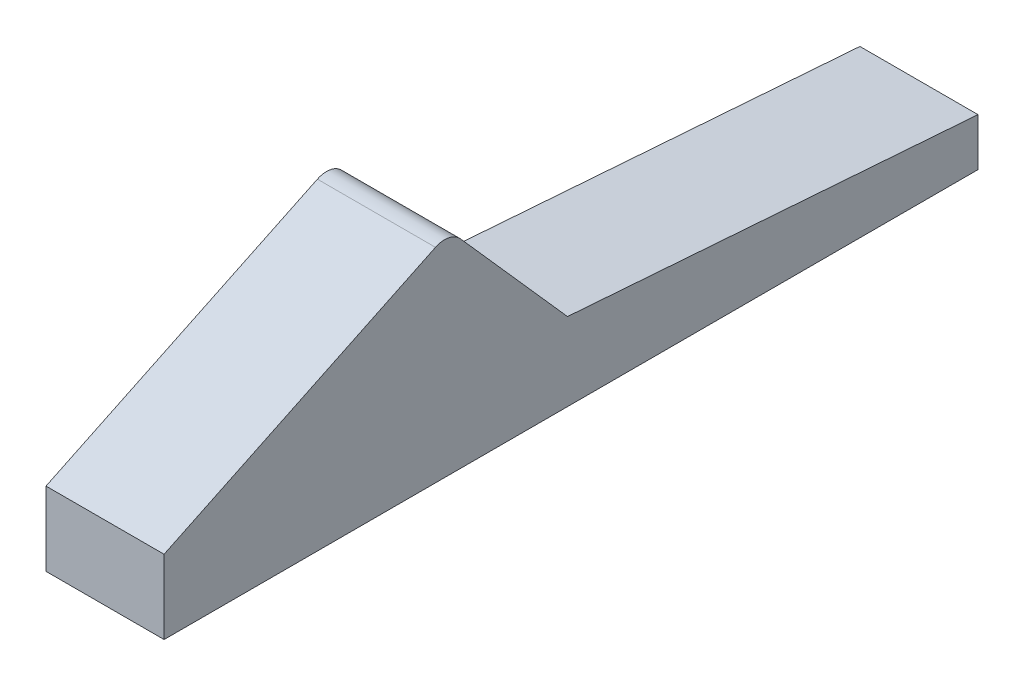
ISO-10303-21;
HEADER;
FILE_DESCRIPTION(('STEP AP214'),'2;1');
FILE_NAME('part.step','',(''),(''),'','','');
FILE_SCHEMA(('AUTOMOTIVE_DESIGN { 1 0 10303 214 1 1 1 1 }'));
ENDSEC;
DATA;
#1=APPLICATION_CONTEXT('core data for automotive mechanical design processes');
#2=APPLICATION_PROTOCOL_DEFINITION('international standard','automotive_design',2000,#1);
#3=PRODUCT_CONTEXT('',#1,'mechanical');
#4=PRODUCT('Part','Part','',(#3));
#5=PRODUCT_RELATED_PRODUCT_CATEGORY('part','',(#4));
#6=PRODUCT_DEFINITION_FORMATION('','',#4);
#7=PRODUCT_DEFINITION_CONTEXT('part definition',#1,'design');
#8=PRODUCT_DEFINITION('design','',#6,#7);
#9=PRODUCT_DEFINITION_SHAPE('','',#8);
#10=(LENGTH_UNIT() NAMED_UNIT(*) SI_UNIT(.MILLI.,.METRE.));
#11=(NAMED_UNIT(*) PLANE_ANGLE_UNIT() SI_UNIT($,.RADIAN.));
#12=(NAMED_UNIT(*) SI_UNIT($,.STERADIAN.) SOLID_ANGLE_UNIT());
#13=UNCERTAINTY_MEASURE_WITH_UNIT(LENGTH_MEASURE(1.E-05),#10,'distance_accuracy_value','');
#14=(GEOMETRIC_REPRESENTATION_CONTEXT(3) GLOBAL_UNCERTAINTY_ASSIGNED_CONTEXT((#13)) GLOBAL_UNIT_ASSIGNED_CONTEXT((#10,
#11,#12)) REPRESENTATION_CONTEXT('',''));
#15=CARTESIAN_POINT('',(0.,0.,0.));
#16=DIRECTION('',(0.,0.,1.));
#17=DIRECTION('',(1.,0.,0.));
#18=AXIS2_PLACEMENT_3D('',#15,#16,#17);
#19=CARTESIAN_POINT('',(3.38899081923676,31.4874983767543,159.021588396583));
#20=DIRECTION('',(0.,0.,1.));
#21=DIRECTION('',(0.,-1.,0.));
#22=AXIS2_PLACEMENT_3D('',#19,#20,#21);
#23=PLANE('',#22);
#24=DIRECTION('',(0.,-1.,0.));
#25=VECTOR('',#24,1.);
#26=CARTESIAN_POINT('',(2.82899081923676,31.4874983767543,159.021588396583));
#27=LINE('',#26,#25);
#28=CARTESIAN_POINT('',(2.82899081923676,30.7134983767543,159.021588396583));
#29=VERTEX_POINT('',#28);
#30=CARTESIAN_POINT('',(2.82899081923676,30.4874983767543,159.021588396583));
#31=VERTEX_POINT('',#30);
#32=EDGE_CURVE('E141',#29,#31,#27,.T.);
#33=ORIENTED_EDGE('',*,*,#32,.F.);
#34=DIRECTION('',(1.,0.,0.));
#35=VECTOR('',#34,1.);
#36=CARTESIAN_POINT('',(2.38899081923676,30.7134983767543,159.021588396583));
#37=LINE('',#36,#35);
#38=CARTESIAN_POINT('',(3.38899081923676,30.7134983767543,159.021588396583));
#39=VERTEX_POINT('',#38);
#40=EDGE_CURVE('E90',#29,#39,#37,.T.);
#41=ORIENTED_EDGE('',*,*,#40,.T.);
#42=DIRECTION('',(0.,-1.,0.));
#43=VECTOR('',#42,1.);
#44=CARTESIAN_POINT('',(3.38899081923676,31.4874983767543,159.021588396583));
#45=LINE('',#44,#43);
#46=CARTESIAN_POINT('',(3.38899081923676,30.4874983767543,159.021588396583));
#47=VERTEX_POINT('',#46);
#48=EDGE_CURVE('E95',#39,#47,#45,.T.);
#49=ORIENTED_EDGE('',*,*,#48,.T.);
#50=DIRECTION('',(-1.,0.,0.));
#51=VECTOR('',#50,1.);
#52=CARTESIAN_POINT('',(3.38899081923676,30.4874983767543,159.021588396583));
#53=LINE('',#52,#51);
#54=EDGE_CURVE('E119',#47,#31,#53,.T.);
#55=ORIENTED_EDGE('',*,*,#54,.T.);
#56=EDGE_LOOP('',(#33,#41,#49,#55));
#57=FACE_BOUND('',#56,.T.);
#58=ADVANCED_FACE('F17',(#57),#23,.F.);
#59=CARTESIAN_POINT('',(2.82899081923676,31.4874983767543,159.021588396583));
#60=DIRECTION('',(1.,0.,0.));
#61=DIRECTION('',(0.,1.,0.));
#62=AXIS2_PLACEMENT_3D('',#59,#60,#61);
#63=PLANE('',#62);
#64=DIRECTION('',(0.,0.432255420004612,-0.901751213959059));
#65=VECTOR('',#64,1.);
#66=CARTESIAN_POINT('',(2.82899081923677,32.4638638990212,159.489610266));
#67=LINE('',#66,#65);
#68=CARTESIAN_POINT('',(2.82899081923679,30.8379155123873,162.881588396583));
#69=VERTEX_POINT('',#68);
#70=CARTESIAN_POINT('',(2.82899081923678,31.4548836689918,161.594498036475));
#71=VERTEX_POINT('',#70);
#72=EDGE_CURVE('E116',#69,#71,#67,.T.);
#73=ORIENTED_EDGE('',*,*,#72,.T.);
#74=CARTESIAN_POINT('',(2.82899081923678,31.3647085475959,161.551272494475));
#75=DIRECTION('',(1.,0.,0.));
#76=DIRECTION('',(0.,1.,0.));
#77=AXIS2_PLACEMENT_3D('',#74,#75,#76);
#78=CIRCLE('',#77,0.1);
#79=CARTESIAN_POINT('',(2.82899081923678,31.4310227222689,161.476423110794));
#80=VERTEX_POINT('',#79);
#81=EDGE_CURVE('E40',#71,#80,#78,.F.);
#82=ORIENTED_EDGE('',*,*,#81,.T.);
#83=DIRECTION('',(0.,-0.748493836810502,-0.663141746730436));
#84=VECTOR('',#83,1.);
#85=CARTESIAN_POINT('',(2.82899081923677,30.2441871666159,160.424924534919));
#86=LINE('',#85,#84);
#87=CARTESIAN_POINT('',(2.82899081923677,30.8574983767543,160.968298771524));
#88=VERTEX_POINT('',#87);
#89=EDGE_CURVE('E103',#80,#88,#86,.T.);
#90=ORIENTED_EDGE('',*,*,#89,.T.);
#91=DIRECTION('',(0.,-0.073769395194858,-0.997275326242751));
#92=VECTOR('',#91,1.);
#93=CARTESIAN_POINT('',(2.82899081923676,30.7177104256729,159.078530336371));
#94=LINE('',#93,#92);
#95=EDGE_CURVE('E88',#88,#29,#94,.T.);
#96=ORIENTED_EDGE('',*,*,#95,.T.);
#97=ORIENTED_EDGE('',*,*,#32,.T.);
#98=DIRECTION('',(0.,0.,1.));
#99=VECTOR('',#98,1.);
#100=CARTESIAN_POINT('',(2.82899081923676,30.4874983767543,159.021588396583));
#101=LINE('',#100,#99);
#102=CARTESIAN_POINT('',(2.82899081923679,30.4874983767543,162.881588396583));
#103=VERTEX_POINT('',#102);
#104=EDGE_CURVE('E123',#31,#103,#101,.T.);
#105=ORIENTED_EDGE('',*,*,#104,.T.);
#106=DIRECTION('',(0.,-1.,0.));
#107=VECTOR('',#106,1.);
#108=CARTESIAN_POINT('',(2.82899081923679,31.4874983767543,162.881588396583));
#109=LINE('',#108,#107);
#110=EDGE_CURVE('E138',#69,#103,#109,.T.);
#111=ORIENTED_EDGE('',*,*,#110,.F.);
#112=EDGE_LOOP('',(#73,#82,#90,#96,#97,#105,#111));
#113=FACE_BOUND('',#112,.T.);
#114=ADVANCED_FACE('F158',(#113),#63,.F.);
#115=CARTESIAN_POINT('',(3.38899081923678,31.4874983767543,162.881588396583));
#116=DIRECTION('',(0.,0.,-1.));
#117=DIRECTION('',(0.,1.,0.));
#118=AXIS2_PLACEMENT_3D('',#115,#116,#117);
#119=PLANE('',#118);
#120=DIRECTION('',(0.,-1.,0.));
#121=VECTOR('',#120,1.);
#122=CARTESIAN_POINT('',(3.38899081923678,31.4874983767543,162.881588396583));
#123=LINE('',#122,#121);
#124=CARTESIAN_POINT('',(3.38899081923678,30.8379155123873,162.881588396583));
#125=VERTEX_POINT('',#124);
#126=CARTESIAN_POINT('',(3.38899081923678,30.4874983767543,162.881588396583));
#127=VERTEX_POINT('',#126);
#128=EDGE_CURVE('E135',#125,#127,#123,.T.);
#129=ORIENTED_EDGE('',*,*,#128,.F.);
#130=DIRECTION('',(1.,0.,0.));
#131=VECTOR('',#130,1.);
#132=CARTESIAN_POINT('',(2.38899081923678,30.8379155123873,162.881588396583));
#133=LINE('',#132,#131);
#134=EDGE_CURVE('E113',#69,#125,#133,.T.);
#135=ORIENTED_EDGE('',*,*,#134,.F.);
#136=ORIENTED_EDGE('',*,*,#110,.T.);
#137=DIRECTION('',(1.,0.,0.));
#138=VECTOR('',#137,1.);
#139=CARTESIAN_POINT('',(3.38899081923678,30.4874983767543,162.881588396583));
#140=LINE('',#139,#138);
#141=EDGE_CURVE('E127',#103,#127,#140,.T.);
#142=ORIENTED_EDGE('',*,*,#141,.T.);
#143=EDGE_LOOP('',(#129,#135,#136,#142));
#144=FACE_BOUND('',#143,.T.);
#145=ADVANCED_FACE('F163',(#144),#119,.F.);
#146=CARTESIAN_POINT('',(3.38899081923676,31.4874983767543,159.021588396583));
#147=DIRECTION('',(-1.,0.,0.));
#148=DIRECTION('',(0.,-1.,0.));
#149=AXIS2_PLACEMENT_3D('',#146,#147,#148);
#150=PLANE('',#149);
#151=DIRECTION('',(0.,-0.748493836810502,-0.663141746730436));
#152=VECTOR('',#151,1.);
#153=CARTESIAN_POINT('',(3.38899081923713,74.4192747137368,199.56264788986));
#154=LINE('',#153,#152);
#155=CARTESIAN_POINT('',(3.38899081923678,31.4310227222689,161.476423110794));
#156=VERTEX_POINT('',#155);
#157=CARTESIAN_POINT('',(3.38899081923677,30.8574983767543,160.968298771524));
#158=VERTEX_POINT('',#157);
#159=EDGE_CURVE('E73',#156,#158,#154,.T.);
#160=ORIENTED_EDGE('',*,*,#159,.F.);
#161=CARTESIAN_POINT('',(3.38899081923678,31.3647085475959,161.551272494475));
#162=DIRECTION('',(-1.,0.,0.));
#163=DIRECTION('',(0.,-1.,0.));
#164=AXIS2_PLACEMENT_3D('',#161,#162,#163);
#165=CIRCLE('',#164,0.1);
#166=CARTESIAN_POINT('',(3.38899081923678,31.4548836689918,161.594498036475));
#167=VERTEX_POINT('',#166);
#168=EDGE_CURVE('E11',#156,#167,#165,.F.);
#169=ORIENTED_EDGE('',*,*,#168,.T.);
#170=DIRECTION('',(0.,0.432255420004612,-0.901751213959059));
#171=VECTOR('',#170,1.);
#172=CARTESIAN_POINT('',(3.38899081923662,44.0030381087839,135.417120089641));
#173=LINE('',#172,#171);
#174=EDGE_CURVE('E109',#125,#167,#173,.T.);
#175=ORIENTED_EDGE('',*,*,#174,.F.);
#176=ORIENTED_EDGE('',*,*,#128,.T.);
#177=DIRECTION('',(0.,0.,-1.));
#178=VECTOR('',#177,1.);
#179=CARTESIAN_POINT('',(3.38899081923676,30.4874983767543,159.021588396583));
#180=LINE('',#179,#178);
#181=EDGE_CURVE('E130',#127,#47,#180,.T.);
#182=ORIENTED_EDGE('',*,*,#181,.T.);
#183=ORIENTED_EDGE('',*,*,#48,.F.);
#184=DIRECTION('',(0.,-0.073769395194858,-0.997275326242751));
#185=VECTOR('',#184,1.);
#186=CARTESIAN_POINT('',(3.38899081923683,31.5421488634984,170.223966867031));
#187=LINE('',#186,#185);
#188=EDGE_CURVE('E81',#158,#39,#187,.T.);
#189=ORIENTED_EDGE('',*,*,#188,.F.);
#190=EDGE_LOOP('',(#160,#169,#175,#176,#182,#183,#189));
#191=FACE_BOUND('',#190,.T.);
#192=ADVANCED_FACE('F93',(#191),#150,.F.);
#193=CARTESIAN_POINT('',(2.82899081923676,30.4874983767543,159.021588396583));
#194=DIRECTION('',(0.,1.,0.));
#195=DIRECTION('',(0.,0.,1.));
#196=AXIS2_PLACEMENT_3D('',#193,#194,#195);
#197=PLANE('',#196);
#198=ORIENTED_EDGE('',*,*,#54,.F.);
#199=ORIENTED_EDGE('',*,*,#181,.F.);
#200=ORIENTED_EDGE('',*,*,#141,.F.);
#201=ORIENTED_EDGE('',*,*,#104,.F.);
#202=EDGE_LOOP('',(#198,#199,#200,#201));
#203=FACE_BOUND('',#202,.T.);
#204=ADVANCED_FACE('F181',(#203),#197,.F.);
#205=CARTESIAN_POINT('',(2.38899081923662,44.0030381087839,135.417120089641));
#206=DIRECTION('',(0.,-0.901751213959059,-0.432255420004612));
#207=DIRECTION('',(0.,0.432255420004612,-0.901751213959059));
#208=AXIS2_PLACEMENT_3D('',#205,#206,#207);
#209=PLANE('',#208);
#210=ORIENTED_EDGE('',*,*,#174,.T.);
#211=DIRECTION('',(-1.,0.,0.));
#212=VECTOR('',#211,1.);
#213=CARTESIAN_POINT('',(2.38899081923678,31.4548836689918,161.594498036475));
#214=LINE('',#213,#212);
#215=EDGE_CURVE('E144',#167,#71,#214,.T.);
#216=ORIENTED_EDGE('',*,*,#215,.T.);
#217=ORIENTED_EDGE('',*,*,#72,.F.);
#218=ORIENTED_EDGE('',*,*,#134,.T.);
#219=EDGE_LOOP('',(#210,#216,#217,#218));
#220=FACE_BOUND('',#219,.T.);
#221=ADVANCED_FACE('F153',(#220),#209,.F.);
#222=CARTESIAN_POINT('',(2.38899081923683,31.5421488634984,170.223966867031));
#223=DIRECTION('',(0.,-0.997275326242751,0.073769395194858));
#224=DIRECTION('',(0.,-0.073769395194858,-0.997275326242751));
#225=AXIS2_PLACEMENT_3D('',#222,#223,#224);
#226=PLANE('',#225);
#227=DIRECTION('',(1.,0.,0.));
#228=VECTOR('',#227,1.);
#229=CARTESIAN_POINT('',(2.38899081923677,30.8574983767543,160.968298771524));
#230=LINE('',#229,#228);
#231=EDGE_CURVE('E76',#88,#158,#230,.T.);
#232=ORIENTED_EDGE('',*,*,#231,.T.);
#233=ORIENTED_EDGE('',*,*,#188,.T.);
#234=ORIENTED_EDGE('',*,*,#40,.F.);
#235=ORIENTED_EDGE('',*,*,#95,.F.);
#236=EDGE_LOOP('',(#232,#233,#234,#235));
#237=FACE_BOUND('',#236,.T.);
#238=ADVANCED_FACE('F85',(#237),#226,.F.);
#239=CARTESIAN_POINT('',(2.38899081923713,74.4192747137368,199.56264788986));
#240=DIRECTION('',(0.,-0.663141746730436,0.748493836810502));
#241=DIRECTION('',(0.,-0.748493836810502,-0.663141746730436));
#242=AXIS2_PLACEMENT_3D('',#239,#240,#241);
#243=PLANE('',#242);
#244=ORIENTED_EDGE('',*,*,#89,.F.);
#245=DIRECTION('',(-1.,0.,0.));
#246=VECTOR('',#245,1.);
#247=CARTESIAN_POINT('',(2.38899081923678,31.4310227222689,161.476423110794));
#248=LINE('',#247,#246);
#249=EDGE_CURVE('E26',#80,#156,#248,.F.);
#250=ORIENTED_EDGE('',*,*,#249,.T.);
#251=ORIENTED_EDGE('',*,*,#159,.T.);
#252=ORIENTED_EDGE('',*,*,#231,.F.);
#253=EDGE_LOOP('',(#244,#250,#251,#252));
#254=FACE_BOUND('',#253,.T.);
#255=ADVANCED_FACE('F75',(#254),#243,.F.);
#256=CARTESIAN_POINT('',(2.38899081923678,31.3647085475959,161.551272494475));
#257=DIRECTION('',(-1.,0.,0.));
#258=DIRECTION('',(0.,0.,-1.));
#259=AXIS2_PLACEMENT_3D('',#256,#257,#258);
#260=CYLINDRICAL_SURFACE('',#259,0.1);
#261=ORIENTED_EDGE('',*,*,#168,.F.);
#262=ORIENTED_EDGE('',*,*,#249,.F.);
#263=ORIENTED_EDGE('',*,*,#81,.F.);
#264=ORIENTED_EDGE('',*,*,#215,.F.);
#265=EDGE_LOOP('',(#261,#262,#263,#264));
#266=FACE_BOUND('',#265,.T.);
#267=ADVANCED_FACE('F19',(#266),#260,.T.);
#268=CLOSED_SHELL('',(#58,#114,#145,#192,#204,#221,#238,#255,#267));
#269=MANIFOLD_SOLID_BREP('B1',#268);
#270=ADVANCED_BREP_SHAPE_REPRESENTATION('',(#18,#269),#14);
#271=SHAPE_DEFINITION_REPRESENTATION(#9,#270);
ENDSEC;
END-ISO-10303-21;
